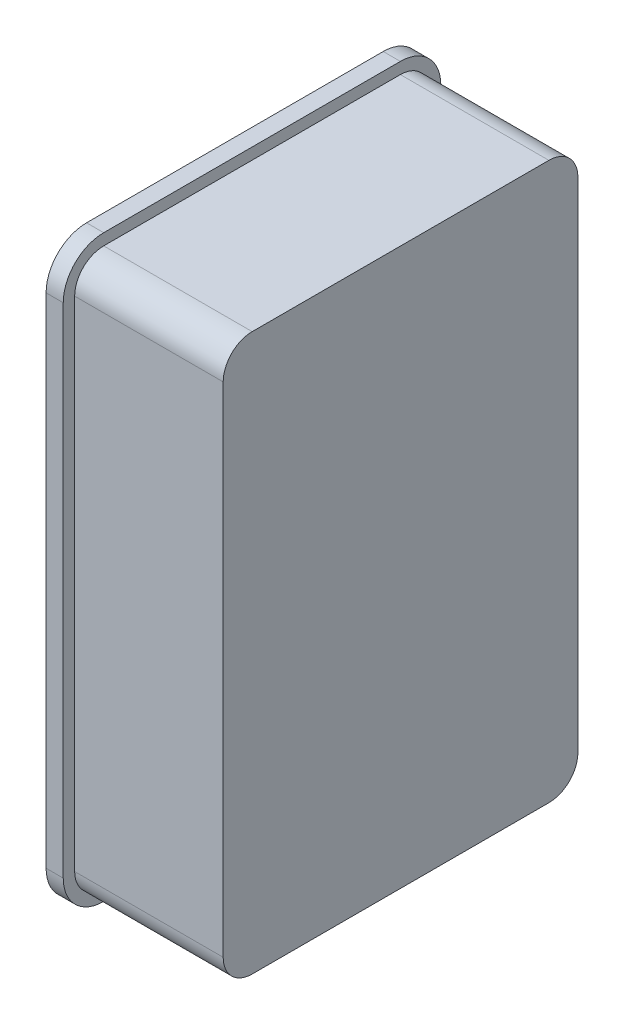
ISO-10303-21;
HEADER;
FILE_DESCRIPTION(('STEP AP214'),'2;1');
FILE_NAME('part.step','',(''),(''),'','','');
FILE_SCHEMA(('AUTOMOTIVE_DESIGN { 1 0 10303 214 1 1 1 1 }'));
ENDSEC;
DATA;
#1=APPLICATION_CONTEXT('core data for automotive mechanical design processes');
#2=APPLICATION_PROTOCOL_DEFINITION('international standard','automotive_design',2000,#1);
#3=PRODUCT_CONTEXT('',#1,'mechanical');
#4=PRODUCT('Part','Part','',(#3));
#5=PRODUCT_RELATED_PRODUCT_CATEGORY('part','',(#4));
#6=PRODUCT_DEFINITION_FORMATION('','',#4);
#7=PRODUCT_DEFINITION_CONTEXT('part definition',#1,'design');
#8=PRODUCT_DEFINITION('design','',#6,#7);
#9=PRODUCT_DEFINITION_SHAPE('','',#8);
#10=(LENGTH_UNIT() NAMED_UNIT(*) SI_UNIT(.MILLI.,.METRE.));
#11=(NAMED_UNIT(*) PLANE_ANGLE_UNIT() SI_UNIT($,.RADIAN.));
#12=(NAMED_UNIT(*) SI_UNIT($,.STERADIAN.) SOLID_ANGLE_UNIT());
#13=UNCERTAINTY_MEASURE_WITH_UNIT(LENGTH_MEASURE(1.E-05),#10,'distance_accuracy_value','');
#14=(GEOMETRIC_REPRESENTATION_CONTEXT(3) GLOBAL_UNCERTAINTY_ASSIGNED_CONTEXT((#13)) GLOBAL_UNIT_ASSIGNED_CONTEXT((#10,
#11,#12)) REPRESENTATION_CONTEXT('',''));
#15=CARTESIAN_POINT('',(0.,0.,0.));
#16=DIRECTION('',(0.,0.,1.));
#17=DIRECTION('',(1.,0.,0.));
#18=AXIS2_PLACEMENT_3D('',#15,#16,#17);
#19=CARTESIAN_POINT('',(-1.5,-3.81,-2.54));
#20=DIRECTION('',(-1.,0.,0.));
#21=DIRECTION('',(0.,0.,1.));
#22=AXIS2_PLACEMENT_3D('',#19,#20,#21);
#23=PLANE('',#22);
#24=DIRECTION('',(0.,-1.,0.));
#25=VECTOR('',#24,1.);
#26=CARTESIAN_POINT('',(-1.5,44.3896078054371,-1.6));
#27=LINE('',#26,#25);
#28=CARTESIAN_POINT('',(-1.5,42.1696609926004,-1.6));
#29=VERTEX_POINT('',#28);
#30=CARTESIAN_POINT('',(-1.5,-6.16966099260042,-1.6));
#31=VERTEX_POINT('',#30);
#32=EDGE_CURVE('E225',#29,#31,#27,.T.);
#33=ORIENTED_EDGE('',*,*,#32,.T.);
#34=CARTESIAN_POINT('',(-1.5,-3.81,-2.54));
#35=DIRECTION('',(-1.,0.,0.));
#36=DIRECTION('',(0.,0.,1.));
#37=AXIS2_PLACEMENT_3D('',#34,#35,#36);
#38=CIRCLE('',#37,2.54);
#39=CARTESIAN_POINT('',(-1.5,-6.35,-2.54));
#40=VERTEX_POINT('',#39);
#41=EDGE_CURVE('E236',#40,#31,#38,.T.);
#42=ORIENTED_EDGE('',*,*,#41,.F.);
#43=DIRECTION('',(0.,0.,1.));
#44=VECTOR('',#43,1.);
#45=CARTESIAN_POINT('',(-1.5,-6.35,-2.54));
#46=LINE('',#45,#44);
#47=CARTESIAN_POINT('',(-1.5,-6.35,-28.51));
#48=VERTEX_POINT('',#47);
#49=EDGE_CURVE('E199',#48,#40,#46,.T.);
#50=ORIENTED_EDGE('',*,*,#49,.F.);
#51=CARTESIAN_POINT('',(-1.5,-3.81,-28.51));
#52=DIRECTION('',(-1.,0.,0.));
#53=DIRECTION('',(0.,0.,1.));
#54=AXIS2_PLACEMENT_3D('',#51,#52,#53);
#55=CIRCLE('',#54,2.54);
#56=CARTESIAN_POINT('',(-1.5,-5.44951212255353,-30.45));
#57=VERTEX_POINT('',#56);
#58=EDGE_CURVE('E191',#57,#48,#55,.T.);
#59=ORIENTED_EDGE('',*,*,#58,.F.);
#60=DIRECTION('',(0.,-1.,0.));
#61=VECTOR('',#60,1.);
#62=CARTESIAN_POINT('',(-1.5,44.3896078054371,-30.45));
#63=LINE('',#62,#61);
#64=CARTESIAN_POINT('',(-1.5,41.4495121225535,-30.45));
#65=VERTEX_POINT('',#64);
#66=EDGE_CURVE('E197',#65,#57,#63,.T.);
#67=ORIENTED_EDGE('',*,*,#66,.F.);
#68=CARTESIAN_POINT('',(-1.5,39.81,-28.51));
#69=DIRECTION('',(-1.,0.,0.));
#70=DIRECTION('',(0.,0.,1.));
#71=AXIS2_PLACEMENT_3D('',#68,#69,#70);
#72=CIRCLE('',#71,2.54);
#73=CARTESIAN_POINT('',(-1.5,42.35,-28.51));
#74=VERTEX_POINT('',#73);
#75=EDGE_CURVE('E202',#74,#65,#72,.T.);
#76=ORIENTED_EDGE('',*,*,#75,.F.);
#77=DIRECTION('',(0.,0.,-1.));
#78=VECTOR('',#77,1.);
#79=CARTESIAN_POINT('',(-1.5,42.35,-28.51));
#80=LINE('',#79,#78);
#81=CARTESIAN_POINT('',(-1.5,42.35,-2.54));
#82=VERTEX_POINT('',#81);
#83=EDGE_CURVE('E242',#82,#74,#80,.T.);
#84=ORIENTED_EDGE('',*,*,#83,.F.);
#85=CARTESIAN_POINT('',(-1.5,39.81,-2.54));
#86=DIRECTION('',(-1.,0.,0.));
#87=DIRECTION('',(0.,0.,1.));
#88=AXIS2_PLACEMENT_3D('',#85,#86,#87);
#89=CIRCLE('',#88,2.54);
#90=EDGE_CURVE('E239',#29,#82,#89,.T.);
#91=ORIENTED_EDGE('',*,*,#90,.F.);
#92=EDGE_LOOP('',(#33,#42,#50,#59,#67,#76,#84,#91));
#93=FACE_BOUND('',#92,.T.);
#94=CARTESIAN_POINT('',(-1.5,-3.81,-2.54));
#95=DIRECTION('',(-1.,0.,0.));
#96=DIRECTION('',(0.,0.,1.));
#97=AXIS2_PLACEMENT_3D('',#94,#95,#96);
#98=CIRCLE('',#97,3.54);
#99=CARTESIAN_POINT('',(-1.5,-7.35,-2.54));
#100=VERTEX_POINT('',#99);
#101=CARTESIAN_POINT('',(-1.5,-3.80999999999999,0.999999999999996));
#102=VERTEX_POINT('',#101);
#103=EDGE_CURVE('E286',#100,#102,#98,.T.);
#104=ORIENTED_EDGE('',*,*,#103,.T.);
#105=DIRECTION('',(0.,1.,0.));
#106=VECTOR('',#105,1.);
#107=CARTESIAN_POINT('',(-1.5,39.81,0.999999999999996));
#108=LINE('',#107,#106);
#109=CARTESIAN_POINT('',(-1.5,39.81,0.999999999999997));
#110=VERTEX_POINT('',#109);
#111=EDGE_CURVE('E288',#102,#110,#108,.T.);
#112=ORIENTED_EDGE('',*,*,#111,.T.);
#113=CARTESIAN_POINT('',(-1.5,39.81,-2.54));
#114=DIRECTION('',(-1.,0.,0.));
#115=DIRECTION('',(0.,0.,1.));
#116=AXIS2_PLACEMENT_3D('',#113,#114,#115);
#117=CIRCLE('',#116,3.54);
#118=CARTESIAN_POINT('',(-1.5,43.35,-2.54));
#119=VERTEX_POINT('',#118);
#120=EDGE_CURVE('E291',#110,#119,#117,.T.);
#121=ORIENTED_EDGE('',*,*,#120,.T.);
#122=DIRECTION('',(0.,0.,-1.));
#123=VECTOR('',#122,1.);
#124=CARTESIAN_POINT('',(-1.5,43.35,-28.51));
#125=LINE('',#124,#123);
#126=CARTESIAN_POINT('',(-1.5,43.35,-28.51));
#127=VERTEX_POINT('',#126);
#128=EDGE_CURVE('E293',#119,#127,#125,.T.);
#129=ORIENTED_EDGE('',*,*,#128,.T.);
#130=CARTESIAN_POINT('',(-1.5,39.81,-28.51));
#131=DIRECTION('',(-1.,0.,0.));
#132=DIRECTION('',(0.,0.,1.));
#133=AXIS2_PLACEMENT_3D('',#130,#131,#132);
#134=CIRCLE('',#133,3.54);
#135=CARTESIAN_POINT('',(-1.5,39.81,-32.05));
#136=VERTEX_POINT('',#135);
#137=EDGE_CURVE('E295',#127,#136,#134,.T.);
#138=ORIENTED_EDGE('',*,*,#137,.T.);
#139=DIRECTION('',(0.,-1.,0.));
#140=VECTOR('',#139,1.);
#141=CARTESIAN_POINT('',(-1.5,-3.81,-32.05));
#142=LINE('',#141,#140);
#143=CARTESIAN_POINT('',(-1.5,-3.81,-32.05));
#144=VERTEX_POINT('',#143);
#145=EDGE_CURVE('E297',#136,#144,#142,.T.);
#146=ORIENTED_EDGE('',*,*,#145,.T.);
#147=CARTESIAN_POINT('',(-1.5,-3.81,-28.51));
#148=DIRECTION('',(-1.,0.,0.));
#149=DIRECTION('',(0.,0.,1.));
#150=AXIS2_PLACEMENT_3D('',#147,#148,#149);
#151=CIRCLE('',#150,3.54);
#152=CARTESIAN_POINT('',(-1.5,-7.35,-28.51));
#153=VERTEX_POINT('',#152);
#154=EDGE_CURVE('E299',#144,#153,#151,.T.);
#155=ORIENTED_EDGE('',*,*,#154,.T.);
#156=DIRECTION('',(0.,0.,1.));
#157=VECTOR('',#156,1.);
#158=CARTESIAN_POINT('',(-1.5,-7.35,-2.54));
#159=LINE('',#158,#157);
#160=EDGE_CURVE('E301',#153,#100,#159,.T.);
#161=ORIENTED_EDGE('',*,*,#160,.T.);
#162=EDGE_LOOP('',(#104,#112,#121,#129,#138,#146,#155,#161));
#163=FACE_BOUND('',#162,.T.);
#164=ADVANCED_FACE('F54',(#93,#163),#23,.T.);
#165=CARTESIAN_POINT('',(-1.5,-3.81,-2.54));
#166=DIRECTION('',(1.,0.,0.));
#167=DIRECTION('',(0.,0.,-1.));
#168=AXIS2_PLACEMENT_3D('',#165,#166,#167);
#169=CYLINDRICAL_SURFACE('',#168,3.54);
#170=DIRECTION('',(1.,0.,0.));
#171=VECTOR('',#170,1.);
#172=CARTESIAN_POINT('',(-1.5,-3.80999999999999,0.999999999999996));
#173=LINE('',#172,#171);
#174=CARTESIAN_POINT('',(0.,-3.80999999999999,0.999999999999996));
#175=VERTEX_POINT('',#174);
#176=EDGE_CURVE('E213',#102,#175,#173,.T.);
#177=ORIENTED_EDGE('',*,*,#176,.F.);
#178=ORIENTED_EDGE('',*,*,#103,.F.);
#179=DIRECTION('',(1.,0.,0.));
#180=VECTOR('',#179,1.);
#181=CARTESIAN_POINT('',(-1.5,-7.35,-2.54));
#182=LINE('',#181,#180);
#183=CARTESIAN_POINT('',(0.,-7.35,-2.54));
#184=VERTEX_POINT('',#183);
#185=EDGE_CURVE('E303',#100,#184,#182,.T.);
#186=ORIENTED_EDGE('',*,*,#185,.T.);
#187=CARTESIAN_POINT('',(0.,-3.81,-2.54));
#188=DIRECTION('',(-1.,0.,0.));
#189=DIRECTION('',(0.,0.,1.));
#190=AXIS2_PLACEMENT_3D('',#187,#188,#189);
#191=CIRCLE('',#190,3.54);
#192=EDGE_CURVE('E285',#184,#175,#191,.T.);
#193=ORIENTED_EDGE('',*,*,#192,.T.);
#194=EDGE_LOOP('',(#177,#178,#186,#193));
#195=FACE_BOUND('',#194,.T.);
#196=ADVANCED_FACE('F56',(#195),#169,.T.);
#197=CARTESIAN_POINT('',(-1.5,39.81,-2.54));
#198=DIRECTION('',(1.,0.,0.));
#199=DIRECTION('',(0.,0.,-1.));
#200=AXIS2_PLACEMENT_3D('',#197,#198,#199);
#201=CYLINDRICAL_SURFACE('',#200,3.54);
#202=DIRECTION('',(1.,0.,0.));
#203=VECTOR('',#202,1.);
#204=CARTESIAN_POINT('',(-1.5,43.35,-2.54));
#205=LINE('',#204,#203);
#206=CARTESIAN_POINT('',(0.,43.35,-2.54));
#207=VERTEX_POINT('',#206);
#208=EDGE_CURVE('E333',#119,#207,#205,.T.);
#209=ORIENTED_EDGE('',*,*,#208,.F.);
#210=ORIENTED_EDGE('',*,*,#120,.F.);
#211=DIRECTION('',(1.,0.,0.));
#212=VECTOR('',#211,1.);
#213=CARTESIAN_POINT('',(-1.5,39.81,0.999999999999997));
#214=LINE('',#213,#212);
#215=CARTESIAN_POINT('',(0.,39.81,0.999999999999997));
#216=VERTEX_POINT('',#215);
#217=EDGE_CURVE('E336',#110,#216,#214,.T.);
#218=ORIENTED_EDGE('',*,*,#217,.T.);
#219=CARTESIAN_POINT('',(0.,39.81,-2.54));
#220=DIRECTION('',(-1.,0.,0.));
#221=DIRECTION('',(0.,0.,1.));
#222=AXIS2_PLACEMENT_3D('',#219,#220,#221);
#223=CIRCLE('',#222,3.54);
#224=EDGE_CURVE('E308',#216,#207,#223,.T.);
#225=ORIENTED_EDGE('',*,*,#224,.T.);
#226=EDGE_LOOP('',(#209,#210,#218,#225));
#227=FACE_BOUND('',#226,.T.);
#228=ADVANCED_FACE('F398',(#227),#201,.T.);
#229=CARTESIAN_POINT('',(-1.5,39.81,-28.51));
#230=DIRECTION('',(1.,0.,0.));
#231=DIRECTION('',(0.,0.,-1.));
#232=AXIS2_PLACEMENT_3D('',#229,#230,#231);
#233=CYLINDRICAL_SURFACE('',#232,3.54);
#234=DIRECTION('',(1.,0.,0.));
#235=VECTOR('',#234,1.);
#236=CARTESIAN_POINT('',(-1.5,39.81,-32.05));
#237=LINE('',#236,#235);
#238=CARTESIAN_POINT('',(0.,39.81,-32.05));
#239=VERTEX_POINT('',#238);
#240=EDGE_CURVE('E327',#136,#239,#237,.T.);
#241=ORIENTED_EDGE('',*,*,#240,.F.);
#242=ORIENTED_EDGE('',*,*,#137,.F.);
#243=DIRECTION('',(1.,0.,0.));
#244=VECTOR('',#243,1.);
#245=CARTESIAN_POINT('',(-1.5,43.35,-28.51));
#246=LINE('',#245,#244);
#247=CARTESIAN_POINT('',(0.,43.35,-28.51));
#248=VERTEX_POINT('',#247);
#249=EDGE_CURVE('E330',#127,#248,#246,.T.);
#250=ORIENTED_EDGE('',*,*,#249,.T.);
#251=CARTESIAN_POINT('',(0.,39.81,-28.51));
#252=DIRECTION('',(-1.,0.,0.));
#253=DIRECTION('',(0.,0.,1.));
#254=AXIS2_PLACEMENT_3D('',#251,#252,#253);
#255=CIRCLE('',#254,3.54);
#256=EDGE_CURVE('E312',#248,#239,#255,.T.);
#257=ORIENTED_EDGE('',*,*,#256,.T.);
#258=EDGE_LOOP('',(#241,#242,#250,#257));
#259=FACE_BOUND('',#258,.T.);
#260=ADVANCED_FACE('F410',(#259),#233,.T.);
#261=CARTESIAN_POINT('',(-1.5,-3.81,-28.51));
#262=DIRECTION('',(1.,0.,0.));
#263=DIRECTION('',(0.,0.,-1.));
#264=AXIS2_PLACEMENT_3D('',#261,#262,#263);
#265=CYLINDRICAL_SURFACE('',#264,3.54);
#266=DIRECTION('',(1.,0.,0.));
#267=VECTOR('',#266,1.);
#268=CARTESIAN_POINT('',(-1.5,-7.35,-28.51));
#269=LINE('',#268,#267);
#270=CARTESIAN_POINT('',(0.,-7.35,-28.51));
#271=VERTEX_POINT('',#270);
#272=EDGE_CURVE('E321',#153,#271,#269,.T.);
#273=ORIENTED_EDGE('',*,*,#272,.F.);
#274=ORIENTED_EDGE('',*,*,#154,.F.);
#275=DIRECTION('',(1.,0.,0.));
#276=VECTOR('',#275,1.);
#277=CARTESIAN_POINT('',(-1.5,-3.81,-32.05));
#278=LINE('',#277,#276);
#279=CARTESIAN_POINT('',(0.,-3.81,-32.05));
#280=VERTEX_POINT('',#279);
#281=EDGE_CURVE('E324',#144,#280,#278,.T.);
#282=ORIENTED_EDGE('',*,*,#281,.T.);
#283=CARTESIAN_POINT('',(0.,-3.81,-28.51));
#284=DIRECTION('',(-1.,0.,0.));
#285=DIRECTION('',(0.,0.,1.));
#286=AXIS2_PLACEMENT_3D('',#283,#284,#285);
#287=CIRCLE('',#286,3.54);
#288=EDGE_CURVE('E316',#280,#271,#287,.T.);
#289=ORIENTED_EDGE('',*,*,#288,.T.);
#290=EDGE_LOOP('',(#273,#274,#282,#289));
#291=FACE_BOUND('',#290,.T.);
#292=ADVANCED_FACE('F407',(#291),#265,.T.);
#293=CARTESIAN_POINT('',(-1.5,-3.81,-2.54));
#294=DIRECTION('',(1.,0.,0.));
#295=DIRECTION('',(0.,0.,-1.));
#296=AXIS2_PLACEMENT_3D('',#293,#294,#295);
#297=CYLINDRICAL_SURFACE('',#296,2.54);
#298=ORIENTED_EDGE('',*,*,#41,.T.);
#299=CARTESIAN_POINT('',(-0.560000000000003,-3.81,-2.54));
#300=DIRECTION('',(0.707106781186552,0.,0.707106781186543));
#301=DIRECTION('',(0.707106781186543,0.,-0.707106781186552));
#302=AXIS2_PLACEMENT_3D('',#299,#300,#301);
#303=ELLIPSE('',#302,3.59210244842764,2.54);
#304=CARTESIAN_POINT('',(-1.1,-6.29193472919817,-2.));
#305=VERTEX_POINT('',#304);
#306=EDGE_CURVE('E232',#31,#305,#303,.T.);
#307=ORIENTED_EDGE('',*,*,#306,.T.);
#308=CARTESIAN_POINT('',(-1.1,-3.81,-2.54));
#309=DIRECTION('',(-1.,0.,0.));
#310=DIRECTION('',(0.,0.,1.));
#311=AXIS2_PLACEMENT_3D('',#308,#309,#310);
#312=CIRCLE('',#311,2.54);
#313=CARTESIAN_POINT('',(-1.1,-3.80999999999999,0.));
#314=VERTEX_POINT('',#313);
#315=EDGE_CURVE('E229',#305,#314,#312,.T.);
#316=ORIENTED_EDGE('',*,*,#315,.T.);
#317=DIRECTION('',(1.,0.,0.));
#318=VECTOR('',#317,1.);
#319=CARTESIAN_POINT('',(-1.5,-3.80999999999999,0.));
#320=LINE('',#319,#318);
#321=CARTESIAN_POINT('',(0.,-3.80999999999999,0.));
#322=VERTEX_POINT('',#321);
#323=EDGE_CURVE('E283',#314,#322,#320,.T.);
#324=ORIENTED_EDGE('',*,*,#323,.T.);
#325=CARTESIAN_POINT('',(0.,-3.81,-2.54));
#326=DIRECTION('',(-1.,0.,0.));
#327=DIRECTION('',(0.,0.,1.));
#328=AXIS2_PLACEMENT_3D('',#325,#326,#327);
#329=CIRCLE('',#328,2.54);
#330=CARTESIAN_POINT('',(0.,-6.35,-2.54));
#331=VERTEX_POINT('',#330);
#332=EDGE_CURVE('E235',#331,#322,#329,.T.);
#333=ORIENTED_EDGE('',*,*,#332,.F.);
#334=DIRECTION('',(1.,0.,0.));
#335=VECTOR('',#334,1.);
#336=CARTESIAN_POINT('',(-1.5,-6.35,-2.54));
#337=LINE('',#336,#335);
#338=EDGE_CURVE('E246',#40,#331,#337,.T.);
#339=ORIENTED_EDGE('',*,*,#338,.F.);
#340=EDGE_LOOP('',(#298,#307,#316,#324,#333,#339));
#341=FACE_BOUND('',#340,.T.);
#342=ADVANCED_FACE('F358',(#341),#297,.F.);
#343=CARTESIAN_POINT('',(-1.5,39.81,0.));
#344=DIRECTION('',(0.,0.,-1.));
#345=DIRECTION('',(0.,1.,0.));
#346=AXIS2_PLACEMENT_3D('',#343,#344,#345);
#347=PLANE('',#346);
#348=ORIENTED_EDGE('',*,*,#323,.F.);
#349=DIRECTION('',(0.,-1.,0.));
#350=VECTOR('',#349,1.);
#351=CARTESIAN_POINT('',(-1.1,44.3896078054371,0.));
#352=LINE('',#351,#350);
#353=CARTESIAN_POINT('',(-1.1,39.81,0.));
#354=VERTEX_POINT('',#353);
#355=EDGE_CURVE('E221',#354,#314,#352,.T.);
#356=ORIENTED_EDGE('',*,*,#355,.F.);
#357=DIRECTION('',(1.,0.,0.));
#358=VECTOR('',#357,1.);
#359=CARTESIAN_POINT('',(-1.5,39.81,0.));
#360=LINE('',#359,#358);
#361=CARTESIAN_POINT('',(0.,39.81,0.));
#362=VERTEX_POINT('',#361);
#363=EDGE_CURVE('E281',#354,#362,#360,.T.);
#364=ORIENTED_EDGE('',*,*,#363,.T.);
#365=DIRECTION('',(0.,1.,0.));
#366=VECTOR('',#365,1.);
#367=CARTESIAN_POINT('',(0.,39.81,0.));
#368=LINE('',#367,#366);
#369=EDGE_CURVE('E249',#322,#362,#368,.T.);
#370=ORIENTED_EDGE('',*,*,#369,.F.);
#371=EDGE_LOOP('',(#348,#356,#364,#370));
#372=FACE_BOUND('',#371,.T.);
#373=ADVANCED_FACE('F351',(#372),#347,.T.);
#374=CARTESIAN_POINT('',(-1.5,39.81,-2.54));
#375=DIRECTION('',(1.,0.,0.));
#376=DIRECTION('',(0.,0.,-1.));
#377=AXIS2_PLACEMENT_3D('',#374,#375,#376);
#378=CYLINDRICAL_SURFACE('',#377,2.54);
#379=CARTESIAN_POINT('',(-1.1,39.81,-2.54));
#380=DIRECTION('',(-1.,0.,0.));
#381=DIRECTION('',(0.,0.,1.));
#382=AXIS2_PLACEMENT_3D('',#379,#380,#381);
#383=CIRCLE('',#382,2.54);
#384=CARTESIAN_POINT('',(-1.1,42.2919347291982,-2.));
#385=VERTEX_POINT('',#384);
#386=EDGE_CURVE('E62',#354,#385,#383,.T.);
#387=ORIENTED_EDGE('',*,*,#386,.T.);
#388=CARTESIAN_POINT('',(-0.560000000000003,39.81,-2.54));
#389=DIRECTION('',(0.707106781186552,0.,0.707106781186543));
#390=DIRECTION('',(0.707106781186543,0.,-0.707106781186552));
#391=AXIS2_PLACEMENT_3D('',#388,#389,#390);
#392=ELLIPSE('',#391,3.59210244842764,2.54);
#393=EDGE_CURVE('E13',#385,#29,#392,.T.);
#394=ORIENTED_EDGE('',*,*,#393,.T.);
#395=ORIENTED_EDGE('',*,*,#90,.T.);
#396=DIRECTION('',(1.,0.,0.));
#397=VECTOR('',#396,1.);
#398=CARTESIAN_POINT('',(-1.5,42.35,-2.54));
#399=LINE('',#398,#397);
#400=CARTESIAN_POINT('',(0.,42.35,-2.54));
#401=VERTEX_POINT('',#400);
#402=EDGE_CURVE('E279',#82,#401,#399,.T.);
#403=ORIENTED_EDGE('',*,*,#402,.T.);
#404=CARTESIAN_POINT('',(0.,39.81,-2.54));
#405=DIRECTION('',(-1.,0.,0.));
#406=DIRECTION('',(0.,0.,1.));
#407=AXIS2_PLACEMENT_3D('',#404,#405,#406);
#408=CIRCLE('',#407,2.54);
#409=EDGE_CURVE('E252',#362,#401,#408,.T.);
#410=ORIENTED_EDGE('',*,*,#409,.F.);
#411=ORIENTED_EDGE('',*,*,#363,.F.);
#412=EDGE_LOOP('',(#387,#394,#395,#403,#410,#411));
#413=FACE_BOUND('',#412,.T.);
#414=ADVANCED_FACE('F344',(#413),#378,.F.);
#415=CARTESIAN_POINT('',(-1.5,39.81,-28.51));
#416=DIRECTION('',(1.,0.,0.));
#417=DIRECTION('',(0.,0.,-1.));
#418=AXIS2_PLACEMENT_3D('',#415,#416,#417);
#419=CYLINDRICAL_SURFACE('',#418,2.54);
#420=CARTESIAN_POINT('',(0.439999999999988,39.81,-28.51));
#421=DIRECTION('',(0.707106781186551,0.,-0.707106781186544));
#422=DIRECTION('',(0.707106781186544,0.,0.707106781186551));
#423=AXIS2_PLACEMENT_3D('',#420,#421,#422);
#424=ELLIPSE('',#423,3.59210244842764,2.54);
#425=CARTESIAN_POINT('',(-1.1,41.8299009876724,-30.05));
#426=VERTEX_POINT('',#425);
#427=EDGE_CURVE('E77',#65,#426,#424,.T.);
#428=ORIENTED_EDGE('',*,*,#427,.T.);
#429=CARTESIAN_POINT('',(-1.1,39.81,-28.51));
#430=DIRECTION('',(-1.,0.,0.));
#431=DIRECTION('',(0.,0.,1.));
#432=AXIS2_PLACEMENT_3D('',#429,#430,#431);
#433=CIRCLE('',#432,2.54);
#434=CARTESIAN_POINT('',(-1.1,39.81,-31.05));
#435=VERTEX_POINT('',#434);
#436=EDGE_CURVE('E227',#426,#435,#433,.T.);
#437=ORIENTED_EDGE('',*,*,#436,.T.);
#438=DIRECTION('',(1.,0.,0.));
#439=VECTOR('',#438,1.);
#440=CARTESIAN_POINT('',(-1.5,39.81,-31.05));
#441=LINE('',#440,#439);
#442=CARTESIAN_POINT('',(0.,39.81,-31.05));
#443=VERTEX_POINT('',#442);
#444=EDGE_CURVE('E275',#435,#443,#441,.T.);
#445=ORIENTED_EDGE('',*,*,#444,.T.);
#446=CARTESIAN_POINT('',(0.,39.81,-28.51));
#447=DIRECTION('',(-1.,0.,0.));
#448=DIRECTION('',(0.,0.,1.));
#449=AXIS2_PLACEMENT_3D('',#446,#447,#448);
#450=CIRCLE('',#449,2.54);
#451=CARTESIAN_POINT('',(0.,42.35,-28.51));
#452=VERTEX_POINT('',#451);
#453=EDGE_CURVE('E258',#452,#443,#450,.T.);
#454=ORIENTED_EDGE('',*,*,#453,.F.);
#455=DIRECTION('',(1.,0.,0.));
#456=VECTOR('',#455,1.);
#457=CARTESIAN_POINT('',(-1.5,42.35,-28.51));
#458=LINE('',#457,#456);
#459=EDGE_CURVE('E277',#74,#452,#458,.T.);
#460=ORIENTED_EDGE('',*,*,#459,.F.);
#461=ORIENTED_EDGE('',*,*,#75,.T.);
#462=EDGE_LOOP('',(#428,#437,#445,#454,#460,#461));
#463=FACE_BOUND('',#462,.T.);
#464=ADVANCED_FACE('F371',(#463),#419,.F.);
#465=CARTESIAN_POINT('',(-1.5,-3.81,-31.05));
#466=DIRECTION('',(0.,0.,1.));
#467=DIRECTION('',(1.,0.,0.));
#468=AXIS2_PLACEMENT_3D('',#465,#466,#467);
#469=PLANE('',#468);
#470=ORIENTED_EDGE('',*,*,#444,.F.);
#471=DIRECTION('',(0.,-1.,0.));
#472=VECTOR('',#471,1.);
#473=CARTESIAN_POINT('',(-1.1,44.3896078054371,-31.05));
#474=LINE('',#473,#472);
#475=CARTESIAN_POINT('',(-1.1,-3.81,-31.05));
#476=VERTEX_POINT('',#475);
#477=EDGE_CURVE('E218',#435,#476,#474,.T.);
#478=ORIENTED_EDGE('',*,*,#477,.T.);
#479=DIRECTION('',(1.,0.,0.));
#480=VECTOR('',#479,1.);
#481=CARTESIAN_POINT('',(-1.5,-3.81,-31.05));
#482=LINE('',#481,#480);
#483=CARTESIAN_POINT('',(0.,-3.81,-31.05));
#484=VERTEX_POINT('',#483);
#485=EDGE_CURVE('E273',#476,#484,#482,.T.);
#486=ORIENTED_EDGE('',*,*,#485,.T.);
#487=DIRECTION('',(0.,-1.,0.));
#488=VECTOR('',#487,1.);
#489=CARTESIAN_POINT('',(0.,-3.81,-31.05));
#490=LINE('',#489,#488);
#491=EDGE_CURVE('E261',#443,#484,#490,.T.);
#492=ORIENTED_EDGE('',*,*,#491,.F.);
#493=EDGE_LOOP('',(#470,#478,#486,#492));
#494=FACE_BOUND('',#493,.T.);
#495=ADVANCED_FACE('F373',(#494),#469,.T.);
#496=CARTESIAN_POINT('',(-1.5,-3.81,-28.51));
#497=DIRECTION('',(1.,0.,0.));
#498=DIRECTION('',(0.,0.,-1.));
#499=AXIS2_PLACEMENT_3D('',#496,#497,#498);
#500=CYLINDRICAL_SURFACE('',#499,2.54);
#501=ORIENTED_EDGE('',*,*,#485,.F.);
#502=CARTESIAN_POINT('',(-1.1,-3.81,-28.51));
#503=DIRECTION('',(-1.,0.,0.));
#504=DIRECTION('',(0.,0.,1.));
#505=AXIS2_PLACEMENT_3D('',#502,#503,#504);
#506=CIRCLE('',#505,2.54);
#507=CARTESIAN_POINT('',(-1.1,-5.82990098767242,-30.05));
#508=VERTEX_POINT('',#507);
#509=EDGE_CURVE('E209',#476,#508,#506,.T.);
#510=ORIENTED_EDGE('',*,*,#509,.T.);
#511=CARTESIAN_POINT('',(0.439999999999988,-3.81,-28.51));
#512=DIRECTION('',(0.707106781186551,0.,-0.707106781186544));
#513=DIRECTION('',(0.707106781186544,0.,0.707106781186551));
#514=AXIS2_PLACEMENT_3D('',#511,#512,#513);
#515=ELLIPSE('',#514,3.59210244842764,2.54);
#516=EDGE_CURVE('E205',#508,#57,#515,.T.);
#517=ORIENTED_EDGE('',*,*,#516,.T.);
#518=ORIENTED_EDGE('',*,*,#58,.T.);
#519=DIRECTION('',(1.,0.,0.));
#520=VECTOR('',#519,1.);
#521=CARTESIAN_POINT('',(-1.5,-6.35,-28.51));
#522=LINE('',#521,#520);
#523=CARTESIAN_POINT('',(0.,-6.35,-28.51));
#524=VERTEX_POINT('',#523);
#525=EDGE_CURVE('E271',#48,#524,#522,.T.);
#526=ORIENTED_EDGE('',*,*,#525,.T.);
#527=CARTESIAN_POINT('',(0.,-3.81,-28.51));
#528=DIRECTION('',(-1.,0.,0.));
#529=DIRECTION('',(0.,0.,1.));
#530=AXIS2_PLACEMENT_3D('',#527,#528,#529);
#531=CIRCLE('',#530,2.54);
#532=EDGE_CURVE('E264',#484,#524,#531,.T.);
#533=ORIENTED_EDGE('',*,*,#532,.F.);
#534=EDGE_LOOP('',(#501,#510,#517,#518,#526,#533));
#535=FACE_BOUND('',#534,.T.);
#536=ADVANCED_FACE('F207',(#535),#500,.F.);
#537=CARTESIAN_POINT('',(0.,-3.81,-2.54));
#538=DIRECTION('',(-1.,0.,0.));
#539=DIRECTION('',(0.,0.,1.));
#540=AXIS2_PLACEMENT_3D('',#537,#538,#539);
#541=PLANE('',#540);
#542=ORIENTED_EDGE('',*,*,#192,.F.);
#543=DIRECTION('',(0.,0.,1.));
#544=VECTOR('',#543,1.);
#545=CARTESIAN_POINT('',(0.,-7.35,-2.54));
#546=LINE('',#545,#544);
#547=EDGE_CURVE('E289',#271,#184,#546,.T.);
#548=ORIENTED_EDGE('',*,*,#547,.F.);
#549=ORIENTED_EDGE('',*,*,#288,.F.);
#550=DIRECTION('',(0.,-1.,0.));
#551=VECTOR('',#550,1.);
#552=CARTESIAN_POINT('',(0.,-3.81,-32.05));
#553=LINE('',#552,#551);
#554=EDGE_CURVE('E314',#239,#280,#553,.T.);
#555=ORIENTED_EDGE('',*,*,#554,.F.);
#556=ORIENTED_EDGE('',*,*,#256,.F.);
#557=DIRECTION('',(0.,0.,-1.));
#558=VECTOR('',#557,1.);
#559=CARTESIAN_POINT('',(0.,43.35,-28.51));
#560=LINE('',#559,#558);
#561=EDGE_CURVE('E310',#207,#248,#560,.T.);
#562=ORIENTED_EDGE('',*,*,#561,.F.);
#563=ORIENTED_EDGE('',*,*,#224,.F.);
#564=DIRECTION('',(0.,1.,0.));
#565=VECTOR('',#564,1.);
#566=CARTESIAN_POINT('',(0.,39.81,0.999999999999996));
#567=LINE('',#566,#565);
#568=EDGE_CURVE('E306',#175,#216,#567,.T.);
#569=ORIENTED_EDGE('',*,*,#568,.F.);
#570=EDGE_LOOP('',(#542,#548,#549,#555,#556,#562,#563,#569));
#571=FACE_BOUND('',#570,.T.);
#572=ORIENTED_EDGE('',*,*,#332,.T.);
#573=ORIENTED_EDGE('',*,*,#369,.T.);
#574=ORIENTED_EDGE('',*,*,#409,.T.);
#575=DIRECTION('',(0.,0.,-1.));
#576=VECTOR('',#575,1.);
#577=CARTESIAN_POINT('',(0.,42.35,-28.51));
#578=LINE('',#577,#576);
#579=EDGE_CURVE('E255',#401,#452,#578,.T.);
#580=ORIENTED_EDGE('',*,*,#579,.T.);
#581=ORIENTED_EDGE('',*,*,#453,.T.);
#582=ORIENTED_EDGE('',*,*,#491,.T.);
#583=ORIENTED_EDGE('',*,*,#532,.T.);
#584=DIRECTION('',(0.,0.,1.));
#585=VECTOR('',#584,1.);
#586=CARTESIAN_POINT('',(0.,-6.35,-2.54));
#587=LINE('',#586,#585);
#588=EDGE_CURVE('E240',#524,#331,#587,.T.);
#589=ORIENTED_EDGE('',*,*,#588,.T.);
#590=EDGE_LOOP('',(#572,#573,#574,#580,#581,#582,#583,#589));
#591=FACE_BOUND('',#590,.T.);
#592=ADVANCED_FACE('F363',(#571,#591),#541,.F.);
#593=CARTESIAN_POINT('',(-1.5,39.81,0.999999999999996));
#594=DIRECTION('',(0.,0.,-1.));
#595=DIRECTION('',(-1.,0.,0.));
#596=AXIS2_PLACEMENT_3D('',#593,#594,#595);
#597=PLANE('',#596);
#598=ORIENTED_EDGE('',*,*,#568,.T.);
#599=ORIENTED_EDGE('',*,*,#217,.F.);
#600=ORIENTED_EDGE('',*,*,#111,.F.);
#601=ORIENTED_EDGE('',*,*,#176,.T.);
#602=EDGE_LOOP('',(#598,#599,#600,#601));
#603=FACE_BOUND('',#602,.T.);
#604=ADVANCED_FACE('F404',(#603),#597,.F.);
#605=CARTESIAN_POINT('',(-1.5,43.35,-28.51));
#606=DIRECTION('',(0.,-1.,0.));
#607=DIRECTION('',(0.,0.,-1.));
#608=AXIS2_PLACEMENT_3D('',#605,#606,#607);
#609=PLANE('',#608);
#610=ORIENTED_EDGE('',*,*,#561,.T.);
#611=ORIENTED_EDGE('',*,*,#249,.F.);
#612=ORIENTED_EDGE('',*,*,#128,.F.);
#613=ORIENTED_EDGE('',*,*,#208,.T.);
#614=EDGE_LOOP('',(#610,#611,#612,#613));
#615=FACE_BOUND('',#614,.T.);
#616=ADVANCED_FACE('F414',(#615),#609,.F.);
#617=CARTESIAN_POINT('',(-1.5,-3.81,-32.05));
#618=DIRECTION('',(0.,0.,1.));
#619=DIRECTION('',(1.,0.,0.));
#620=AXIS2_PLACEMENT_3D('',#617,#618,#619);
#621=PLANE('',#620);
#622=ORIENTED_EDGE('',*,*,#554,.T.);
#623=ORIENTED_EDGE('',*,*,#281,.F.);
#624=ORIENTED_EDGE('',*,*,#145,.F.);
#625=ORIENTED_EDGE('',*,*,#240,.T.);
#626=EDGE_LOOP('',(#622,#623,#624,#625));
#627=FACE_BOUND('',#626,.T.);
#628=ADVANCED_FACE('F387',(#627),#621,.F.);
#629=CARTESIAN_POINT('',(-1.5,-7.35,-2.54));
#630=DIRECTION('',(0.,1.,0.));
#631=DIRECTION('',(0.,0.,1.));
#632=AXIS2_PLACEMENT_3D('',#629,#630,#631);
#633=PLANE('',#632);
#634=ORIENTED_EDGE('',*,*,#547,.T.);
#635=ORIENTED_EDGE('',*,*,#185,.F.);
#636=ORIENTED_EDGE('',*,*,#160,.F.);
#637=ORIENTED_EDGE('',*,*,#272,.T.);
#638=EDGE_LOOP('',(#634,#635,#636,#637));
#639=FACE_BOUND('',#638,.T.);
#640=ADVANCED_FACE('F380',(#639),#633,.F.);
#641=CARTESIAN_POINT('',(-1.5,42.35,-28.51));
#642=DIRECTION('',(0.,-1.,0.));
#643=DIRECTION('',(0.,0.,-1.));
#644=AXIS2_PLACEMENT_3D('',#641,#642,#643);
#645=PLANE('',#644);
#646=ORIENTED_EDGE('',*,*,#579,.F.);
#647=ORIENTED_EDGE('',*,*,#402,.F.);
#648=ORIENTED_EDGE('',*,*,#83,.T.);
#649=ORIENTED_EDGE('',*,*,#459,.T.);
#650=EDGE_LOOP('',(#646,#647,#648,#649));
#651=FACE_BOUND('',#650,.T.);
#652=ADVANCED_FACE('F378',(#651),#645,.T.);
#653=CARTESIAN_POINT('',(-1.5,-6.35,-2.54));
#654=DIRECTION('',(0.,1.,0.));
#655=DIRECTION('',(0.,0.,1.));
#656=AXIS2_PLACEMENT_3D('',#653,#654,#655);
#657=PLANE('',#656);
#658=ORIENTED_EDGE('',*,*,#588,.F.);
#659=ORIENTED_EDGE('',*,*,#525,.F.);
#660=ORIENTED_EDGE('',*,*,#49,.T.);
#661=ORIENTED_EDGE('',*,*,#338,.T.);
#662=EDGE_LOOP('',(#658,#659,#660,#661));
#663=FACE_BOUND('',#662,.T.);
#664=ADVANCED_FACE('F361',(#663),#657,.T.);
#665=CARTESIAN_POINT('',(-1.1,44.3896078054371,-30.05));
#666=DIRECTION('',(0.707106781186551,0.,-0.707106781186544));
#667=DIRECTION('',(-0.707106781186544,0.,-0.707106781186551));
#668=AXIS2_PLACEMENT_3D('',#665,#666,#667);
#669=PLANE('',#668);
#670=ORIENTED_EDGE('',*,*,#427,.F.);
#671=ORIENTED_EDGE('',*,*,#66,.T.);
#672=ORIENTED_EDGE('',*,*,#516,.F.);
#673=DIRECTION('',(0.,-1.,0.));
#674=VECTOR('',#673,1.);
#675=CARTESIAN_POINT('',(-1.1,44.3896078054371,-30.05));
#676=LINE('',#675,#674);
#677=EDGE_CURVE('E216',#426,#508,#676,.T.);
#678=ORIENTED_EDGE('',*,*,#677,.F.);
#679=EDGE_LOOP('',(#670,#671,#672,#678));
#680=FACE_BOUND('',#679,.T.);
#681=ADVANCED_FACE('F215',(#680),#669,.F.);
#682=CARTESIAN_POINT('',(-1.1,44.3896078054371,-31.05));
#683=DIRECTION('',(-1.,0.,0.));
#684=DIRECTION('',(0.,0.,1.));
#685=AXIS2_PLACEMENT_3D('',#682,#683,#684);
#686=PLANE('',#685);
#687=ORIENTED_EDGE('',*,*,#436,.F.);
#688=ORIENTED_EDGE('',*,*,#677,.T.);
#689=ORIENTED_EDGE('',*,*,#509,.F.);
#690=ORIENTED_EDGE('',*,*,#477,.F.);
#691=EDGE_LOOP('',(#687,#688,#689,#690));
#692=FACE_BOUND('',#691,.T.);
#693=ADVANCED_FACE('F369',(#692),#686,.F.);
#694=CARTESIAN_POINT('',(-1.1,44.3896078054371,0.));
#695=DIRECTION('',(-1.,0.,0.));
#696=DIRECTION('',(0.,0.,1.));
#697=AXIS2_PLACEMENT_3D('',#694,#695,#696);
#698=PLANE('',#697);
#699=ORIENTED_EDGE('',*,*,#315,.F.);
#700=DIRECTION('',(0.,-1.,0.));
#701=VECTOR('',#700,1.);
#702=CARTESIAN_POINT('',(-1.1,44.3896078054371,-2.));
#703=LINE('',#702,#701);
#704=EDGE_CURVE('E69',#385,#305,#703,.T.);
#705=ORIENTED_EDGE('',*,*,#704,.F.);
#706=ORIENTED_EDGE('',*,*,#386,.F.);
#707=ORIENTED_EDGE('',*,*,#355,.T.);
#708=EDGE_LOOP('',(#699,#705,#706,#707));
#709=FACE_BOUND('',#708,.T.);
#710=ADVANCED_FACE('F348',(#709),#698,.F.);
#711=CARTESIAN_POINT('',(-1.1,44.3896078054371,-2.));
#712=DIRECTION('',(0.707106781186552,0.,0.707106781186543));
#713=DIRECTION('',(0.707106781186543,0.,-0.707106781186552));
#714=AXIS2_PLACEMENT_3D('',#711,#712,#713);
#715=PLANE('',#714);
#716=ORIENTED_EDGE('',*,*,#306,.F.);
#717=ORIENTED_EDGE('',*,*,#32,.F.);
#718=ORIENTED_EDGE('',*,*,#393,.F.);
#719=ORIENTED_EDGE('',*,*,#704,.T.);
#720=EDGE_LOOP('',(#716,#717,#718,#719));
#721=FACE_BOUND('',#720,.T.);
#722=ADVANCED_FACE('F566',(#721),#715,.F.);
#723=CLOSED_SHELL('',(#164,#196,#228,#260,#292,#342,#373,#414,#464,#495,#536,#592,#604,#616,
#628,#640,#652,#664,#681,#693,#710,#722));
#724=MANIFOLD_SOLID_BREP('B2',#723);
#725=CARTESIAN_POINT('',(0.,-3.81,-2.54));
#726=DIRECTION('',(1.,0.,0.));
#727=DIRECTION('',(0.,0.,-1.));
#728=AXIS2_PLACEMENT_3D('',#725,#726,#727);
#729=PLANE('',#728);
#730=CARTESIAN_POINT('',(0.,-3.81,-2.54));
#731=DIRECTION('',(1.,0.,0.));
#732=DIRECTION('',(0.,0.,-1.));
#733=AXIS2_PLACEMENT_3D('',#730,#731,#732);
#734=CIRCLE('',#733,2.54);
#735=CARTESIAN_POINT('',(0.,-3.80999999999999,0.));
#736=VERTEX_POINT('',#735);
#737=CARTESIAN_POINT('',(0.,-6.35,-2.54));
#738=VERTEX_POINT('',#737);
#739=EDGE_CURVE('E710',#736,#738,#734,.T.);
#740=ORIENTED_EDGE('',*,*,#739,.F.);
#741=DIRECTION('',(0.,-1.,0.));
#742=VECTOR('',#741,1.);
#743=CARTESIAN_POINT('',(0.,39.81,0.));
#744=LINE('',#743,#742);
#745=CARTESIAN_POINT('',(0.,39.81,0.));
#746=VERTEX_POINT('',#745);
#747=EDGE_CURVE('E782',#746,#736,#744,.T.);
#748=ORIENTED_EDGE('',*,*,#747,.F.);
#749=CARTESIAN_POINT('',(0.,39.81,-2.54));
#750=DIRECTION('',(1.,0.,0.));
#751=DIRECTION('',(0.,0.,-1.));
#752=AXIS2_PLACEMENT_3D('',#749,#750,#751);
#753=CIRCLE('',#752,2.54);
#754=CARTESIAN_POINT('',(0.,42.35,-2.54));
#755=VERTEX_POINT('',#754);
#756=EDGE_CURVE('E780',#755,#746,#753,.T.);
#757=ORIENTED_EDGE('',*,*,#756,.F.);
#758=DIRECTION('',(0.,0.,1.));
#759=VECTOR('',#758,1.);
#760=CARTESIAN_POINT('',(0.,42.35,-28.51));
#761=LINE('',#760,#759);
#762=CARTESIAN_POINT('',(0.,42.35,-28.51));
#763=VERTEX_POINT('',#762);
#764=EDGE_CURVE('E778',#763,#755,#761,.T.);
#765=ORIENTED_EDGE('',*,*,#764,.F.);
#766=CARTESIAN_POINT('',(0.,39.81,-28.51));
#767=DIRECTION('',(1.,0.,0.));
#768=DIRECTION('',(0.,0.,-1.));
#769=AXIS2_PLACEMENT_3D('',#766,#767,#768);
#770=CIRCLE('',#769,2.54);
#771=CARTESIAN_POINT('',(0.,39.81,-31.05));
#772=VERTEX_POINT('',#771);
#773=EDGE_CURVE('E776',#772,#763,#770,.T.);
#774=ORIENTED_EDGE('',*,*,#773,.F.);
#775=DIRECTION('',(0.,1.,0.));
#776=VECTOR('',#775,1.);
#777=CARTESIAN_POINT('',(0.,-3.81,-31.05));
#778=LINE('',#777,#776);
#779=CARTESIAN_POINT('',(0.,-3.81,-31.05));
#780=VERTEX_POINT('',#779);
#781=EDGE_CURVE('E774',#780,#772,#778,.T.);
#782=ORIENTED_EDGE('',*,*,#781,.F.);
#783=CARTESIAN_POINT('',(0.,-3.81,-28.51));
#784=DIRECTION('',(1.,0.,0.));
#785=DIRECTION('',(0.,0.,-1.));
#786=AXIS2_PLACEMENT_3D('',#783,#784,#785);
#787=CIRCLE('',#786,2.54);
#788=CARTESIAN_POINT('',(0.,-6.35,-28.51));
#789=VERTEX_POINT('',#788);
#790=EDGE_CURVE('E772',#789,#780,#787,.T.);
#791=ORIENTED_EDGE('',*,*,#790,.F.);
#792=DIRECTION('',(0.,0.,-1.));
#793=VECTOR('',#792,1.);
#794=CARTESIAN_POINT('',(0.,-6.35,-2.54));
#795=LINE('',#794,#793);
#796=EDGE_CURVE('E770',#738,#789,#795,.T.);
#797=ORIENTED_EDGE('',*,*,#796,.F.);
#798=EDGE_LOOP('',(#740,#748,#757,#765,#774,#782,#791,#797));
#799=FACE_BOUND('',#798,.T.);
#800=DIRECTION('',(0.,1.,0.));
#801=VECTOR('',#800,1.);
#802=CARTESIAN_POINT('',(0.,36.,-21.525));
#803=LINE('',#802,#801);
#804=CARTESIAN_POINT('',(0.,0.,-21.525));
#805=VERTEX_POINT('',#804);
#806=CARTESIAN_POINT('',(0.,36.,-21.525));
#807=VERTEX_POINT('',#806);
#808=EDGE_CURVE('E637',#805,#807,#803,.T.);
#809=ORIENTED_EDGE('',*,*,#808,.T.);
#810=DIRECTION('',(0.,0.,1.));
#811=VECTOR('',#810,1.);
#812=CARTESIAN_POINT('',(0.,36.,-9.52500000000001));
#813=LINE('',#812,#811);
#814=CARTESIAN_POINT('',(0.,36.,-9.52500000000001));
#815=VERTEX_POINT('',#814);
#816=EDGE_CURVE('E754',#807,#815,#813,.T.);
#817=ORIENTED_EDGE('',*,*,#816,.T.);
#818=DIRECTION('',(0.,-1.,0.));
#819=VECTOR('',#818,1.);
#820=CARTESIAN_POINT('',(0.,0.,-9.525));
#821=LINE('',#820,#819);
#822=CARTESIAN_POINT('',(0.,0.,-9.525));
#823=VERTEX_POINT('',#822);
#824=EDGE_CURVE('E757',#815,#823,#821,.T.);
#825=ORIENTED_EDGE('',*,*,#824,.T.);
#826=DIRECTION('',(0.,0.,-1.));
#827=VECTOR('',#826,1.);
#828=CARTESIAN_POINT('',(0.,0.,-21.525));
#829=LINE('',#828,#827);
#830=EDGE_CURVE('E745',#823,#805,#829,.T.);
#831=ORIENTED_EDGE('',*,*,#830,.T.);
#832=EDGE_LOOP('',(#809,#817,#825,#831));
#833=FACE_BOUND('',#832,.T.);
#834=ADVANCED_FACE('F614',(#799,#833),#729,.F.);
#835=CARTESIAN_POINT('',(12.,-3.81,-2.54));
#836=DIRECTION('',(-1.,0.,0.));
#837=DIRECTION('',(0.,0.,1.));
#838=AXIS2_PLACEMENT_3D('',#835,#836,#837);
#839=CYLINDRICAL_SURFACE('',#838,2.54);
#840=ORIENTED_EDGE('',*,*,#739,.T.);
#841=DIRECTION('',(-1.,0.,0.));
#842=VECTOR('',#841,1.);
#843=CARTESIAN_POINT('',(12.,-6.35,-2.54));
#844=LINE('',#843,#842);
#845=CARTESIAN_POINT('',(13.,-6.35,-2.54));
#846=VERTEX_POINT('',#845);
#847=EDGE_CURVE('E52',#846,#738,#844,.T.);
#848=ORIENTED_EDGE('',*,*,#847,.F.);
#849=CARTESIAN_POINT('',(13.,-3.81,-2.54));
#850=DIRECTION('',(1.,0.,0.));
#851=DIRECTION('',(0.,0.,-1.));
#852=AXIS2_PLACEMENT_3D('',#849,#850,#851);
#853=CIRCLE('',#852,2.54);
#854=CARTESIAN_POINT('',(13.,-3.80999999999999,0.));
#855=VERTEX_POINT('',#854);
#856=EDGE_CURVE('E708',#855,#846,#853,.T.);
#857=ORIENTED_EDGE('',*,*,#856,.F.);
#858=DIRECTION('',(-1.,0.,0.));
#859=VECTOR('',#858,1.);
#860=CARTESIAN_POINT('',(12.,-3.80999999999999,0.));
#861=LINE('',#860,#859);
#862=EDGE_CURVE('E784',#855,#736,#861,.T.);
#863=ORIENTED_EDGE('',*,*,#862,.T.);
#864=EDGE_LOOP('',(#840,#848,#857,#863));
#865=FACE_BOUND('',#864,.T.);
#866=ADVANCED_FACE('F616',(#865),#839,.T.);
#867=CARTESIAN_POINT('',(12.,-6.35,-2.54));
#868=DIRECTION('',(0.,1.,0.));
#869=DIRECTION('',(0.,0.,1.));
#870=AXIS2_PLACEMENT_3D('',#867,#868,#869);
#871=PLANE('',#870);
#872=ORIENTED_EDGE('',*,*,#796,.T.);
#873=DIRECTION('',(-1.,0.,0.));
#874=VECTOR('',#873,1.);
#875=CARTESIAN_POINT('',(12.,-6.35,-28.51));
#876=LINE('',#875,#874);
#877=CARTESIAN_POINT('',(13.,-6.35,-28.51));
#878=VERTEX_POINT('',#877);
#879=EDGE_CURVE('E622',#878,#789,#876,.T.);
#880=ORIENTED_EDGE('',*,*,#879,.F.);
#881=DIRECTION('',(0.,0.,-1.));
#882=VECTOR('',#881,1.);
#883=CARTESIAN_POINT('',(13.,-6.35,-2.54));
#884=LINE('',#883,#882);
#885=EDGE_CURVE('E713',#846,#878,#884,.T.);
#886=ORIENTED_EDGE('',*,*,#885,.F.);
#887=ORIENTED_EDGE('',*,*,#847,.T.);
#888=EDGE_LOOP('',(#872,#880,#886,#887));
#889=FACE_BOUND('',#888,.T.);
#890=ADVANCED_FACE('F714',(#889),#871,.F.);
#891=CARTESIAN_POINT('',(12.,-3.81,-28.51));
#892=DIRECTION('',(-1.,0.,0.));
#893=DIRECTION('',(0.,0.,1.));
#894=AXIS2_PLACEMENT_3D('',#891,#892,#893);
#895=CYLINDRICAL_SURFACE('',#894,2.54);
#896=ORIENTED_EDGE('',*,*,#790,.T.);
#897=DIRECTION('',(-1.,0.,0.));
#898=VECTOR('',#897,1.);
#899=CARTESIAN_POINT('',(12.,-3.81,-31.05));
#900=LINE('',#899,#898);
#901=CARTESIAN_POINT('',(13.,-3.81,-31.05));
#902=VERTEX_POINT('',#901);
#903=EDGE_CURVE('E798',#902,#780,#900,.T.);
#904=ORIENTED_EDGE('',*,*,#903,.F.);
#905=CARTESIAN_POINT('',(13.,-3.81,-28.51));
#906=DIRECTION('',(1.,0.,0.));
#907=DIRECTION('',(0.,0.,-1.));
#908=AXIS2_PLACEMENT_3D('',#905,#906,#907);
#909=CIRCLE('',#908,2.54);
#910=EDGE_CURVE('E719',#878,#902,#909,.T.);
#911=ORIENTED_EDGE('',*,*,#910,.F.);
#912=ORIENTED_EDGE('',*,*,#879,.T.);
#913=EDGE_LOOP('',(#896,#904,#911,#912));
#914=FACE_BOUND('',#913,.T.);
#915=ADVANCED_FACE('F802',(#914),#895,.T.);
#916=CARTESIAN_POINT('',(12.,-3.81,-31.05));
#917=DIRECTION('',(0.,0.,1.));
#918=DIRECTION('',(1.,0.,0.));
#919=AXIS2_PLACEMENT_3D('',#916,#917,#918);
#920=PLANE('',#919);
#921=ORIENTED_EDGE('',*,*,#781,.T.);
#922=DIRECTION('',(-1.,0.,0.));
#923=VECTOR('',#922,1.);
#924=CARTESIAN_POINT('',(12.,39.81,-31.05));
#925=LINE('',#924,#923);
#926=CARTESIAN_POINT('',(13.,39.81,-31.05));
#927=VERTEX_POINT('',#926);
#928=EDGE_CURVE('E795',#927,#772,#925,.T.);
#929=ORIENTED_EDGE('',*,*,#928,.F.);
#930=DIRECTION('',(0.,1.,0.));
#931=VECTOR('',#930,1.);
#932=CARTESIAN_POINT('',(13.,-3.81,-31.05));
#933=LINE('',#932,#931);
#934=EDGE_CURVE('E729',#902,#927,#933,.T.);
#935=ORIENTED_EDGE('',*,*,#934,.F.);
#936=ORIENTED_EDGE('',*,*,#903,.T.);
#937=EDGE_LOOP('',(#921,#929,#935,#936));
#938=FACE_BOUND('',#937,.T.);
#939=ADVANCED_FACE('F809',(#938),#920,.F.);
#940=CARTESIAN_POINT('',(12.,39.81,-28.51));
#941=DIRECTION('',(-1.,0.,0.));
#942=DIRECTION('',(0.,0.,1.));
#943=AXIS2_PLACEMENT_3D('',#940,#941,#942);
#944=CYLINDRICAL_SURFACE('',#943,2.54);
#945=ORIENTED_EDGE('',*,*,#773,.T.);
#946=DIRECTION('',(-1.,0.,0.));
#947=VECTOR('',#946,1.);
#948=CARTESIAN_POINT('',(12.,42.35,-28.51));
#949=LINE('',#948,#947);
#950=CARTESIAN_POINT('',(13.,42.35,-28.51));
#951=VERTEX_POINT('',#950);
#952=EDGE_CURVE('E792',#951,#763,#949,.T.);
#953=ORIENTED_EDGE('',*,*,#952,.F.);
#954=CARTESIAN_POINT('',(13.,39.81,-28.51));
#955=DIRECTION('',(1.,0.,0.));
#956=DIRECTION('',(0.,0.,-1.));
#957=AXIS2_PLACEMENT_3D('',#954,#955,#956);
#958=CIRCLE('',#957,2.54);
#959=EDGE_CURVE('E732',#927,#951,#958,.T.);
#960=ORIENTED_EDGE('',*,*,#959,.F.);
#961=ORIENTED_EDGE('',*,*,#928,.T.);
#962=EDGE_LOOP('',(#945,#953,#960,#961));
#963=FACE_BOUND('',#962,.T.);
#964=ADVANCED_FACE('F813',(#963),#944,.T.);
#965=CARTESIAN_POINT('',(12.,42.35,-28.51));
#966=DIRECTION('',(0.,-1.,0.));
#967=DIRECTION('',(0.,0.,-1.));
#968=AXIS2_PLACEMENT_3D('',#965,#966,#967);
#969=PLANE('',#968);
#970=ORIENTED_EDGE('',*,*,#764,.T.);
#971=DIRECTION('',(-1.,0.,0.));
#972=VECTOR('',#971,1.);
#973=CARTESIAN_POINT('',(12.,42.35,-2.54));
#974=LINE('',#973,#972);
#975=CARTESIAN_POINT('',(13.,42.35,-2.54));
#976=VERTEX_POINT('',#975);
#977=EDGE_CURVE('E789',#976,#755,#974,.T.);
#978=ORIENTED_EDGE('',*,*,#977,.F.);
#979=DIRECTION('',(0.,0.,1.));
#980=VECTOR('',#979,1.);
#981=CARTESIAN_POINT('',(13.,42.35,-28.51));
#982=LINE('',#981,#980);
#983=EDGE_CURVE('E735',#951,#976,#982,.T.);
#984=ORIENTED_EDGE('',*,*,#983,.F.);
#985=ORIENTED_EDGE('',*,*,#952,.T.);
#986=EDGE_LOOP('',(#970,#978,#984,#985));
#987=FACE_BOUND('',#986,.T.);
#988=ADVANCED_FACE('F817',(#987),#969,.F.);
#989=CARTESIAN_POINT('',(12.,39.81,-2.54));
#990=DIRECTION('',(-1.,0.,0.));
#991=DIRECTION('',(0.,0.,1.));
#992=AXIS2_PLACEMENT_3D('',#989,#990,#991);
#993=CYLINDRICAL_SURFACE('',#992,2.54);
#994=ORIENTED_EDGE('',*,*,#756,.T.);
#995=DIRECTION('',(-1.,0.,0.));
#996=VECTOR('',#995,1.);
#997=CARTESIAN_POINT('',(12.,39.81,0.));
#998=LINE('',#997,#996);
#999=CARTESIAN_POINT('',(13.,39.81,0.));
#1000=VERTEX_POINT('',#999);
#1001=EDGE_CURVE('E786',#1000,#746,#998,.T.);
#1002=ORIENTED_EDGE('',*,*,#1001,.F.);
#1003=CARTESIAN_POINT('',(13.,39.81,-2.54));
#1004=DIRECTION('',(1.,0.,0.));
#1005=DIRECTION('',(0.,0.,-1.));
#1006=AXIS2_PLACEMENT_3D('',#1003,#1004,#1005);
#1007=CIRCLE('',#1006,2.54);
#1008=EDGE_CURVE('E738',#976,#1000,#1007,.T.);
#1009=ORIENTED_EDGE('',*,*,#1008,.F.);
#1010=ORIENTED_EDGE('',*,*,#977,.T.);
#1011=EDGE_LOOP('',(#994,#1002,#1009,#1010));
#1012=FACE_BOUND('',#1011,.T.);
#1013=ADVANCED_FACE('F820',(#1012),#993,.T.);
#1014=CARTESIAN_POINT('',(12.,39.81,0.));
#1015=DIRECTION('',(0.,0.,-1.));
#1016=DIRECTION('',(0.,1.,0.));
#1017=AXIS2_PLACEMENT_3D('',#1014,#1015,#1016);
#1018=PLANE('',#1017);
#1019=ORIENTED_EDGE('',*,*,#747,.T.);
#1020=ORIENTED_EDGE('',*,*,#862,.F.);
#1021=DIRECTION('',(0.,-1.,0.));
#1022=VECTOR('',#1021,1.);
#1023=CARTESIAN_POINT('',(13.,39.81,0.));
#1024=LINE('',#1023,#1022);
#1025=EDGE_CURVE('E725',#1000,#855,#1024,.T.);
#1026=ORIENTED_EDGE('',*,*,#1025,.F.);
#1027=ORIENTED_EDGE('',*,*,#1001,.T.);
#1028=EDGE_LOOP('',(#1019,#1020,#1026,#1027));
#1029=FACE_BOUND('',#1028,.T.);
#1030=ADVANCED_FACE('F823',(#1029),#1018,.F.);
#1031=CARTESIAN_POINT('',(12.,36.,-21.525));
#1032=DIRECTION('',(0.,0.,1.));
#1033=DIRECTION('',(1.,0.,0.));
#1034=AXIS2_PLACEMENT_3D('',#1031,#1032,#1033);
#1035=PLANE('',#1034);
#1036=ORIENTED_EDGE('',*,*,#808,.F.);
#1037=DIRECTION('',(-1.,0.,0.));
#1038=VECTOR('',#1037,1.);
#1039=CARTESIAN_POINT('',(12.,0.,-21.525));
#1040=LINE('',#1039,#1038);
#1041=CARTESIAN_POINT('',(12.,0.,-21.525));
#1042=VERTEX_POINT('',#1041);
#1043=EDGE_CURVE('E752',#1042,#805,#1040,.T.);
#1044=ORIENTED_EDGE('',*,*,#1043,.F.);
#1045=DIRECTION('',(0.,1.,0.));
#1046=VECTOR('',#1045,1.);
#1047=CARTESIAN_POINT('',(12.,36.,-21.525));
#1048=LINE('',#1047,#1046);
#1049=CARTESIAN_POINT('',(12.,36.,-21.525));
#1050=VERTEX_POINT('',#1049);
#1051=EDGE_CURVE('E741',#1042,#1050,#1048,.T.);
#1052=ORIENTED_EDGE('',*,*,#1051,.T.);
#1053=DIRECTION('',(-1.,0.,0.));
#1054=VECTOR('',#1053,1.);
#1055=CARTESIAN_POINT('',(12.,36.,-21.525));
#1056=LINE('',#1055,#1054);
#1057=EDGE_CURVE('E767',#1050,#807,#1056,.T.);
#1058=ORIENTED_EDGE('',*,*,#1057,.T.);
#1059=EDGE_LOOP('',(#1036,#1044,#1052,#1058));
#1060=FACE_BOUND('',#1059,.T.);
#1061=ADVANCED_FACE('F825',(#1060),#1035,.T.);
#1062=CARTESIAN_POINT('',(12.,36.,-9.52500000000001));
#1063=DIRECTION('',(0.,-1.,0.));
#1064=DIRECTION('',(0.,0.,-1.));
#1065=AXIS2_PLACEMENT_3D('',#1062,#1063,#1064);
#1066=PLANE('',#1065);
#1067=ORIENTED_EDGE('',*,*,#816,.F.);
#1068=ORIENTED_EDGE('',*,*,#1057,.F.);
#1069=DIRECTION('',(0.,0.,1.));
#1070=VECTOR('',#1069,1.);
#1071=CARTESIAN_POINT('',(12.,36.,-9.52500000000001));
#1072=LINE('',#1071,#1070);
#1073=CARTESIAN_POINT('',(12.,36.,-9.52500000000001));
#1074=VERTEX_POINT('',#1073);
#1075=EDGE_CURVE('E744',#1050,#1074,#1072,.T.);
#1076=ORIENTED_EDGE('',*,*,#1075,.T.);
#1077=DIRECTION('',(-1.,0.,0.));
#1078=VECTOR('',#1077,1.);
#1079=CARTESIAN_POINT('',(12.,36.,-9.52500000000001));
#1080=LINE('',#1079,#1078);
#1081=EDGE_CURVE('E765',#1074,#815,#1080,.T.);
#1082=ORIENTED_EDGE('',*,*,#1081,.T.);
#1083=EDGE_LOOP('',(#1067,#1068,#1076,#1082));
#1084=FACE_BOUND('',#1083,.T.);
#1085=ADVANCED_FACE('F831',(#1084),#1066,.T.);
#1086=CARTESIAN_POINT('',(12.,0.,-9.525));
#1087=DIRECTION('',(0.,0.,-1.));
#1088=DIRECTION('',(0.,1.,0.));
#1089=AXIS2_PLACEMENT_3D('',#1086,#1087,#1088);
#1090=PLANE('',#1089);
#1091=ORIENTED_EDGE('',*,*,#824,.F.);
#1092=ORIENTED_EDGE('',*,*,#1081,.F.);
#1093=DIRECTION('',(0.,-1.,0.));
#1094=VECTOR('',#1093,1.);
#1095=CARTESIAN_POINT('',(12.,0.,-9.525));
#1096=LINE('',#1095,#1094);
#1097=CARTESIAN_POINT('',(12.,0.,-9.525));
#1098=VERTEX_POINT('',#1097);
#1099=EDGE_CURVE('E748',#1074,#1098,#1096,.T.);
#1100=ORIENTED_EDGE('',*,*,#1099,.T.);
#1101=DIRECTION('',(-1.,0.,0.));
#1102=VECTOR('',#1101,1.);
#1103=CARTESIAN_POINT('',(12.,0.,-9.525));
#1104=LINE('',#1103,#1102);
#1105=EDGE_CURVE('E763',#1098,#823,#1104,.T.);
#1106=ORIENTED_EDGE('',*,*,#1105,.T.);
#1107=EDGE_LOOP('',(#1091,#1092,#1100,#1106));
#1108=FACE_BOUND('',#1107,.T.);
#1109=ADVANCED_FACE('F842',(#1108),#1090,.T.);
#1110=CARTESIAN_POINT('',(12.,0.,-21.525));
#1111=DIRECTION('',(0.,1.,0.));
#1112=DIRECTION('',(0.,0.,1.));
#1113=AXIS2_PLACEMENT_3D('',#1110,#1111,#1112);
#1114=PLANE('',#1113);
#1115=ORIENTED_EDGE('',*,*,#830,.F.);
#1116=ORIENTED_EDGE('',*,*,#1105,.F.);
#1117=DIRECTION('',(0.,0.,-1.));
#1118=VECTOR('',#1117,1.);
#1119=CARTESIAN_POINT('',(12.,0.,-21.525));
#1120=LINE('',#1119,#1118);
#1121=EDGE_CURVE('E629',#1098,#1042,#1120,.T.);
#1122=ORIENTED_EDGE('',*,*,#1121,.T.);
#1123=ORIENTED_EDGE('',*,*,#1043,.T.);
#1124=EDGE_LOOP('',(#1115,#1116,#1122,#1123));
#1125=FACE_BOUND('',#1124,.T.);
#1126=ADVANCED_FACE('F846',(#1125),#1114,.T.);
#1127=CARTESIAN_POINT('',(12.,-3.81,-2.54));
#1128=DIRECTION('',(1.,0.,0.));
#1129=DIRECTION('',(0.,0.,-1.));
#1130=AXIS2_PLACEMENT_3D('',#1127,#1128,#1129);
#1131=PLANE('',#1130);
#1132=ORIENTED_EDGE('',*,*,#1075,.F.);
#1133=ORIENTED_EDGE('',*,*,#1051,.F.);
#1134=ORIENTED_EDGE('',*,*,#1121,.F.);
#1135=ORIENTED_EDGE('',*,*,#1099,.F.);
#1136=EDGE_LOOP('',(#1132,#1133,#1134,#1135));
#1137=FACE_BOUND('',#1136,.T.);
#1138=ADVANCED_FACE('F850',(#1137),#1131,.F.);
#1139=CARTESIAN_POINT('',(13.,-3.81,-2.54));
#1140=DIRECTION('',(1.,0.,0.));
#1141=DIRECTION('',(0.,0.,-1.));
#1142=AXIS2_PLACEMENT_3D('',#1139,#1140,#1141);
#1143=PLANE('',#1142);
#1144=ORIENTED_EDGE('',*,*,#856,.T.);
#1145=ORIENTED_EDGE('',*,*,#885,.T.);
#1146=ORIENTED_EDGE('',*,*,#910,.T.);
#1147=ORIENTED_EDGE('',*,*,#934,.T.);
#1148=ORIENTED_EDGE('',*,*,#959,.T.);
#1149=ORIENTED_EDGE('',*,*,#983,.T.);
#1150=ORIENTED_EDGE('',*,*,#1008,.T.);
#1151=ORIENTED_EDGE('',*,*,#1025,.T.);
#1152=EDGE_LOOP('',(#1144,#1145,#1146,#1147,#1148,#1149,#1150,#1151));
#1153=FACE_BOUND('',#1152,.T.);
#1154=ADVANCED_FACE('F722',(#1153),#1143,.T.);
#1155=CLOSED_SHELL('',(#834,#866,#890,#915,#939,#964,#988,#1013,#1030,#1061,#1085,#1109,#1126,
#1138,#1154));
#1156=MANIFOLD_SOLID_BREP('B7',#1155);
#1157=ADVANCED_BREP_SHAPE_REPRESENTATION('',(#18,#724,#1156),#14);
#1158=SHAPE_DEFINITION_REPRESENTATION(#9,#1157);
ENDSEC;
END-ISO-10303-21;
